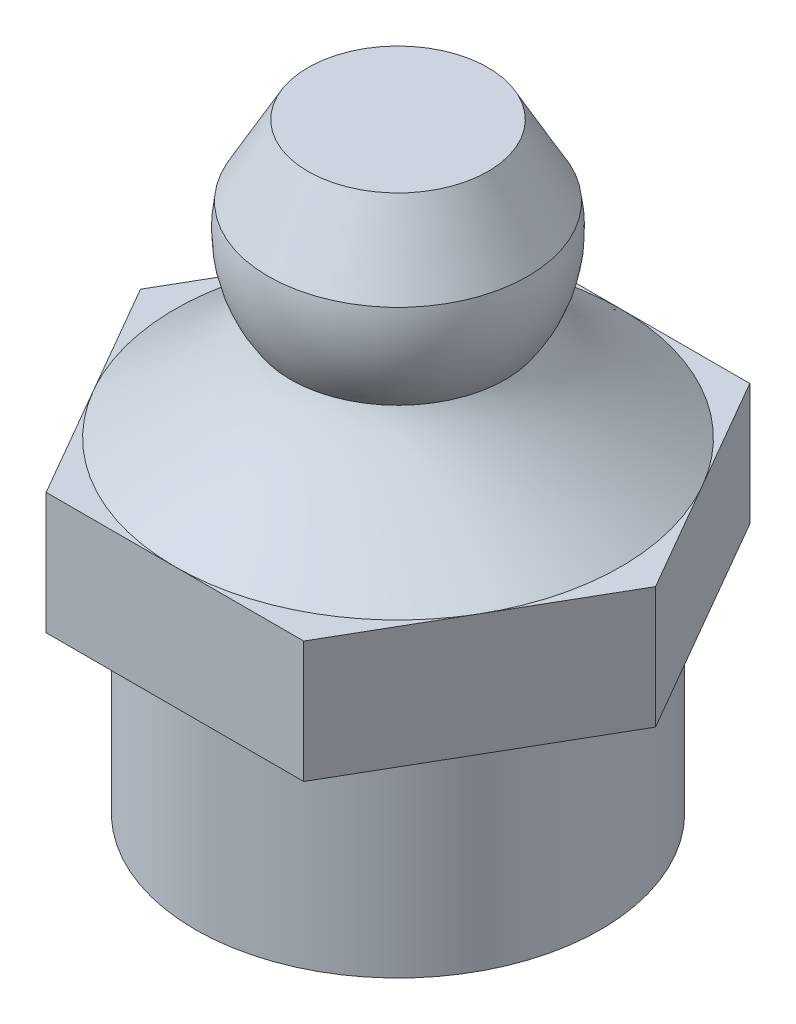
ISO-10303-21;
HEADER;
FILE_DESCRIPTION(('STEP AP214'),'2;1');
FILE_NAME('part.step','',(''),(''),'','','');
FILE_SCHEMA(('AUTOMOTIVE_DESIGN { 1 0 10303 214 1 1 1 1 }'));
ENDSEC;
DATA;
#1=APPLICATION_CONTEXT('core data for automotive mechanical design processes');
#2=APPLICATION_PROTOCOL_DEFINITION('international standard','automotive_design',2000,#1);
#3=PRODUCT_CONTEXT('',#1,'mechanical');
#4=PRODUCT('Part','Part','',(#3));
#5=PRODUCT_RELATED_PRODUCT_CATEGORY('part','',(#4));
#6=PRODUCT_DEFINITION_FORMATION('','',#4);
#7=PRODUCT_DEFINITION_CONTEXT('part definition',#1,'design');
#8=PRODUCT_DEFINITION('design','',#6,#7);
#9=PRODUCT_DEFINITION_SHAPE('','',#8);
#10=(LENGTH_UNIT() NAMED_UNIT(*) SI_UNIT(.MILLI.,.METRE.));
#11=(NAMED_UNIT(*) PLANE_ANGLE_UNIT() SI_UNIT($,.RADIAN.));
#12=(NAMED_UNIT(*) SI_UNIT($,.STERADIAN.) SOLID_ANGLE_UNIT());
#13=UNCERTAINTY_MEASURE_WITH_UNIT(LENGTH_MEASURE(1.E-05),#10,'distance_accuracy_value','');
#14=(GEOMETRIC_REPRESENTATION_CONTEXT(3) GLOBAL_UNCERTAINTY_ASSIGNED_CONTEXT((#13)) GLOBAL_UNIT_ASSIGNED_CONTEXT((#10,
#11,#12)) REPRESENTATION_CONTEXT('',''));
#15=CARTESIAN_POINT('',(0.,0.,0.));
#16=DIRECTION('',(0.,0.,1.));
#17=DIRECTION('',(1.,0.,0.));
#18=AXIS2_PLACEMENT_3D('',#15,#16,#17);
#19=CARTESIAN_POINT('',(0.,8.,0.));
#20=DIRECTION('',(0.,1.,0.));
#21=DIRECTION('',(0.,0.,1.));
#22=AXIS2_PLACEMENT_3D('',#19,#20,#21);
#23=PLANE('',#22);
#24=DIRECTION('',(1.,0.,0.));
#25=VECTOR('',#24,1.);
#26=CARTESIAN_POINT('',(-3.17542648054294,8.,5.5));
#27=LINE('',#26,#25);
#28=CARTESIAN_POINT('',(-3.17542648054294,8.,5.5));
#29=VERTEX_POINT('',#28);
#30=CARTESIAN_POINT('',(0.,8.,5.5));
#31=VERTEX_POINT('',#30);
#32=EDGE_CURVE('E155',#29,#31,#27,.T.);
#33=ORIENTED_EDGE('',*,*,#32,.T.);
#34=CARTESIAN_POINT('',(0.,8.,0.));
#35=DIRECTION('',(0.,-1.,0.));
#36=DIRECTION('',(0.,0.,-1.));
#37=AXIS2_PLACEMENT_3D('',#34,#35,#36);
#38=CIRCLE('',#37,5.5);
#39=CARTESIAN_POINT('',(-4.76299954111656,8.,2.75024191876122));
#40=VERTEX_POINT('',#39);
#41=EDGE_CURVE('E12',#31,#40,#38,.T.);
#42=ORIENTED_EDGE('',*,*,#41,.T.);
#43=DIRECTION('',(0.5,0.,0.866025403784439));
#44=VECTOR('',#43,1.);
#45=CARTESIAN_POINT('',(-6.35085296108588,8.,0.));
#46=LINE('',#45,#44);
#47=EDGE_CURVE('E149',#40,#29,#46,.T.);
#48=ORIENTED_EDGE('',*,*,#47,.T.);
#49=EDGE_LOOP('',(#33,#42,#48));
#50=FACE_BOUND('',#49,.T.);
#51=ADVANCED_FACE('F44',(#50),#23,.T.);
#52=CARTESIAN_POINT('',(-6.35085296108588,8.,0.));
#53=VERTEX_POINT('',#52);
#54=EDGE_CURVE('E124',#53,#40,#46,.T.);
#55=ORIENTED_EDGE('',*,*,#54,.T.);
#56=CARTESIAN_POINT('',(2.58277162522576,8.,-4.85585118510943));
#57=CARTESIAN_POINT('',(-7.1289307449931,8.,-10.021394435561));
#58=CARTESIAN_POINT('',(-12.2944739954446,8.,-0.309692065342095));
#59=CARTESIAN_POINT('',(-2.58277162522576,8.,4.85585118510943));
#60=CARTESIAN_POINT('',(7.1289307449931,8.,10.021394435561));
#61=CARTESIAN_POINT('',(12.2944739954446,8.,0.309692065342091));
#62=CARTESIAN_POINT('',(2.58277162522576,8.,-4.85585118510943));
#63=(BOUNDED_CURVE() B_SPLINE_CURVE(3,(#56,#57,#58,#59,#60,#61,#62),.UNSPECIFIED.,.T.,
.F.) B_SPLINE_CURVE_WITH_KNOTS((4,3,4),(0.,0.5,1.),
.UNSPECIFIED.) CURVE() GEOMETRIC_REPRESENTATION_ITEM() RATIONAL_B_SPLINE_CURVE((1.,
0.333333333333333,0.333333333333333,1.,0.333333333333333,0.333333333333333,1.)) REPRESENTATION_ITEM(''));
#64=CARTESIAN_POINT('',(-4.76318664763266,8.,-2.74992585731315));
#65=VERTEX_POINT('',#64);
#66=EDGE_CURVE('E54',#40,#65,#63,.F.);
#67=ORIENTED_EDGE('',*,*,#66,.T.);
#68=DIRECTION('',(-0.5,0.,0.866025403784438));
#69=VECTOR('',#68,1.);
#70=CARTESIAN_POINT('',(-3.17542648054294,8.,-5.5));
#71=LINE('',#70,#69);
#72=EDGE_CURVE('E119',#65,#53,#71,.T.);
#73=ORIENTED_EDGE('',*,*,#72,.T.);
#74=EDGE_LOOP('',(#55,#67,#73));
#75=FACE_BOUND('',#74,.T.);
#76=ADVANCED_FACE('F121',(#75),#23,.T.);
#77=CARTESIAN_POINT('',(-3.17542648054294,8.,-5.5));
#78=VERTEX_POINT('',#77);
#79=EDGE_CURVE('E131',#78,#65,#71,.T.);
#80=ORIENTED_EDGE('',*,*,#79,.T.);
#81=CARTESIAN_POINT('',(0.,8.,0.));
#82=DIRECTION('',(0.,1.,0.));
#83=DIRECTION('',(0.,0.,1.));
#84=AXIS2_PLACEMENT_3D('',#81,#82,#83);
#85=CIRCLE('',#84,5.5);
#86=CARTESIAN_POINT('',(0.000547968911664734,8.,-5.5000000000506));
#87=VERTEX_POINT('',#86);
#88=EDGE_CURVE('E279',#87,#65,#85,.T.);
#89=ORIENTED_EDGE('',*,*,#88,.F.);
#90=DIRECTION('',(-1.,0.,0.));
#91=VECTOR('',#90,1.);
#92=CARTESIAN_POINT('',(3.17542648054294,8.,-5.5));
#93=LINE('',#92,#91);
#94=EDGE_CURVE('E267',#87,#78,#93,.T.);
#95=ORIENTED_EDGE('',*,*,#94,.T.);
#96=EDGE_LOOP('',(#80,#89,#95));
#97=FACE_BOUND('',#96,.T.);
#98=ADVANCED_FACE('F276',(#97),#23,.T.);
#99=CARTESIAN_POINT('',(3.17542648054294,8.,-5.5));
#100=VERTEX_POINT('',#99);
#101=EDGE_CURVE('E132',#100,#87,#93,.T.);
#102=ORIENTED_EDGE('',*,*,#101,.T.);
#103=CARTESIAN_POINT('',(2.58277162522576,8.,-4.85585118510943));
#104=CARTESIAN_POINT('',(-7.1289307449931,8.,-10.021394435561));
#105=CARTESIAN_POINT('',(-12.2944739954446,8.,-0.309692065342095));
#106=CARTESIAN_POINT('',(-2.58277162522576,8.,4.85585118510943));
#107=CARTESIAN_POINT('',(7.1289307449931,8.,10.021394435561));
#108=CARTESIAN_POINT('',(12.2944739954446,8.,0.309692065342091));
#109=CARTESIAN_POINT('',(2.58277162522576,8.,-4.85585118510943));
#110=(BOUNDED_CURVE() B_SPLINE_CURVE(3,(#103,#104,#105,#106,#107,#108,#109),.UNSPECIFIED.,.T.,
.F.) B_SPLINE_CURVE_WITH_KNOTS((4,3,4),(0.,0.5,1.),
.UNSPECIFIED.) CURVE() GEOMETRIC_REPRESENTATION_ITEM() RATIONAL_B_SPLINE_CURVE((1.,
0.333333333333333,0.333333333333333,1.,0.333333333333333,0.333333333333333,1.)) REPRESENTATION_ITEM(''));
#111=CARTESIAN_POINT('',(4.76299954111715,8.,-2.75024191876018));
#112=VERTEX_POINT('',#111);
#113=EDGE_CURVE('E390',#87,#112,#110,.F.);
#114=ORIENTED_EDGE('',*,*,#113,.T.);
#115=DIRECTION('',(-0.5,0.,-0.866025403784438));
#116=VECTOR('',#115,1.);
#117=CARTESIAN_POINT('',(6.35085296108588,8.,0.));
#118=LINE('',#117,#116);
#119=EDGE_CURVE('E262',#112,#100,#118,.T.);
#120=ORIENTED_EDGE('',*,*,#119,.T.);
#121=EDGE_LOOP('',(#102,#114,#120));
#122=FACE_BOUND('',#121,.T.);
#123=ADVANCED_FACE('F394',(#122),#23,.T.);
#124=CARTESIAN_POINT('',(6.35085296108588,8.,0.));
#125=VERTEX_POINT('',#124);
#126=EDGE_CURVE('E264',#125,#112,#118,.T.);
#127=ORIENTED_EDGE('',*,*,#126,.T.);
#128=CARTESIAN_POINT('',(2.58277162522576,8.,-4.85585118510943));
#129=CARTESIAN_POINT('',(-7.1289307449931,8.,-10.021394435561));
#130=CARTESIAN_POINT('',(-12.2944739954446,8.,-0.309692065342095));
#131=CARTESIAN_POINT('',(-2.58277162522576,8.,4.85585118510943));
#132=CARTESIAN_POINT('',(7.1289307449931,8.,10.021394435561));
#133=CARTESIAN_POINT('',(12.2944739954446,8.,0.309692065342091));
#134=CARTESIAN_POINT('',(2.58277162522576,8.,-4.85585118510943));
#135=(BOUNDED_CURVE() B_SPLINE_CURVE(3,(#128,#129,#130,#131,#132,#133,#134),.UNSPECIFIED.,.T.,
.F.) B_SPLINE_CURVE_WITH_KNOTS((4,3,4),(0.,0.5,1.),
.UNSPECIFIED.) CURVE() GEOMETRIC_REPRESENTATION_ITEM() RATIONAL_B_SPLINE_CURVE((1.,
0.333333333333333,0.333333333333333,1.,0.333333333333333,0.333333333333333,1.)) REPRESENTATION_ITEM(''));
#136=CARTESIAN_POINT('',(4.76318664169245,8.,2.74992586760205));
#137=VERTEX_POINT('',#136);
#138=EDGE_CURVE('E388',#112,#137,#135,.F.);
#139=ORIENTED_EDGE('',*,*,#138,.T.);
#140=DIRECTION('',(0.5,0.,-0.866025403784439));
#141=VECTOR('',#140,1.);
#142=CARTESIAN_POINT('',(3.17542648054294,8.,5.5));
#143=LINE('',#142,#141);
#144=EDGE_CURVE('E105',#137,#125,#143,.T.);
#145=ORIENTED_EDGE('',*,*,#144,.T.);
#146=EDGE_LOOP('',(#127,#139,#145));
#147=FACE_BOUND('',#146,.T.);
#148=ADVANCED_FACE('F421',(#147),#23,.T.);
#149=CARTESIAN_POINT('',(3.17542648054294,8.,5.5));
#150=VERTEX_POINT('',#149);
#151=EDGE_CURVE('E250',#150,#137,#143,.T.);
#152=ORIENTED_EDGE('',*,*,#151,.T.);
#153=CARTESIAN_POINT('',(2.58277162522576,8.,-4.85585118510943));
#154=CARTESIAN_POINT('',(-7.1289307449931,8.,-10.021394435561));
#155=CARTESIAN_POINT('',(-12.2944739954446,8.,-0.309692065342095));
#156=CARTESIAN_POINT('',(-2.58277162522576,8.,4.85585118510943));
#157=CARTESIAN_POINT('',(7.1289307449931,8.,10.021394435561));
#158=CARTESIAN_POINT('',(12.2944739954446,8.,0.309692065342091));
#159=CARTESIAN_POINT('',(2.58277162522576,8.,-4.85585118510943));
#160=(BOUNDED_CURVE() B_SPLINE_CURVE(3,(#153,#154,#155,#156,#157,#158,#159),.UNSPECIFIED.,.T.,
.F.) B_SPLINE_CURVE_WITH_KNOTS((4,3,4),(0.,0.5,1.),
.UNSPECIFIED.) CURVE() GEOMETRIC_REPRESENTATION_ITEM() RATIONAL_B_SPLINE_CURVE((1.,
0.333333333333333,0.333333333333333,1.,0.333333333333333,0.333333333333333,1.)) REPRESENTATION_ITEM(''));
#161=EDGE_CURVE('E177',#137,#31,#160,.F.);
#162=ORIENTED_EDGE('',*,*,#161,.T.);
#163=EDGE_CURVE('E68',#31,#150,#27,.T.);
#164=ORIENTED_EDGE('',*,*,#163,.T.);
#165=EDGE_LOOP('',(#152,#162,#164));
#166=FACE_BOUND('',#165,.T.);
#167=ADVANCED_FACE('F195',(#166),#23,.T.);
#168=CARTESIAN_POINT('',(0.,5.,0.));
#169=DIRECTION('',(0.,-1.,0.));
#170=DIRECTION('',(0.,0.,-1.));
#171=AXIS2_PLACEMENT_3D('',#168,#169,#170);
#172=CYLINDRICAL_SURFACE('',#171,5.);
#173=CARTESIAN_POINT('',(0.,5.,0.));
#174=DIRECTION('',(0.,1.,0.));
#175=DIRECTION('',(0.,0.,1.));
#176=AXIS2_PLACEMENT_3D('',#173,#174,#175);
#177=CIRCLE('',#176,5.);
#178=CARTESIAN_POINT('',(0.,5.,5.));
#179=VERTEX_POINT('',#178);
#180=EDGE_CURVE('E235',#179,#179,#177,.T.);
#181=ORIENTED_EDGE('',*,*,#180,.F.);
#182=EDGE_LOOP('',(#181));
#183=FACE_BOUND('',#182,.T.);
#184=CARTESIAN_POINT('',(0.,0.,0.));
#185=DIRECTION('',(0.,1.,0.));
#186=DIRECTION('',(0.,0.,1.));
#187=AXIS2_PLACEMENT_3D('',#184,#185,#186);
#188=CIRCLE('',#187,5.);
#189=CARTESIAN_POINT('',(0.,0.,5.));
#190=VERTEX_POINT('',#189);
#191=EDGE_CURVE('E232',#190,#190,#188,.T.);
#192=ORIENTED_EDGE('',*,*,#191,.T.);
#193=EDGE_LOOP('',(#192));
#194=FACE_BOUND('',#193,.T.);
#195=ADVANCED_FACE('F46',(#183,#194),#172,.T.);
#196=CARTESIAN_POINT('',(0.,0.,0.));
#197=DIRECTION('',(0.,1.,0.));
#198=DIRECTION('',(0.,0.,1.));
#199=AXIS2_PLACEMENT_3D('',#196,#197,#198);
#200=PLANE('',#199);
#201=ORIENTED_EDGE('',*,*,#191,.F.);
#202=EDGE_LOOP('',(#201));
#203=FACE_BOUND('',#202,.T.);
#204=ADVANCED_FACE('F222',(#203),#200,.F.);
#205=CARTESIAN_POINT('',(3.17542648054294,8.,5.5));
#206=DIRECTION('',(-0.866025403784439,0.,-0.5));
#207=DIRECTION('',(-0.5,0.,0.866025403784439));
#208=AXIS2_PLACEMENT_3D('',#205,#206,#207);
#209=PLANE('',#208);
#210=DIRECTION('',(0.5,0.,-0.866025403784439));
#211=VECTOR('',#210,1.);
#212=CARTESIAN_POINT('',(3.17542648054294,5.,5.5));
#213=LINE('',#212,#211);
#214=CARTESIAN_POINT('',(3.17542648054294,5.,5.5));
#215=VERTEX_POINT('',#214);
#216=CARTESIAN_POINT('',(6.35085296108588,5.,0.));
#217=VERTEX_POINT('',#216);
#218=EDGE_CURVE('E169',#215,#217,#213,.T.);
#219=ORIENTED_EDGE('',*,*,#218,.T.);
#220=DIRECTION('',(0.,-1.,0.));
#221=VECTOR('',#220,1.);
#222=CARTESIAN_POINT('',(6.35085296108588,8.,0.));
#223=LINE('',#222,#221);
#224=EDGE_CURVE('E236',#125,#217,#223,.T.);
#225=ORIENTED_EDGE('',*,*,#224,.F.);
#226=ORIENTED_EDGE('',*,*,#144,.F.);
#227=ORIENTED_EDGE('',*,*,#151,.F.);
#228=DIRECTION('',(0.,-1.,0.));
#229=VECTOR('',#228,1.);
#230=CARTESIAN_POINT('',(3.17542648054294,8.,5.5));
#231=LINE('',#230,#229);
#232=EDGE_CURVE('E175',#150,#215,#231,.T.);
#233=ORIENTED_EDGE('',*,*,#232,.T.);
#234=EDGE_LOOP('',(#219,#225,#226,#227,#233));
#235=FACE_BOUND('',#234,.T.);
#236=ADVANCED_FACE('F219',(#235),#209,.F.);
#237=CARTESIAN_POINT('',(6.35085296108588,8.,0.));
#238=DIRECTION('',(-0.866025403784438,0.,0.5));
#239=DIRECTION('',(0.5,0.,0.866025403784438));
#240=AXIS2_PLACEMENT_3D('',#237,#238,#239);
#241=PLANE('',#240);
#242=DIRECTION('',(-0.5,0.,-0.866025403784438));
#243=VECTOR('',#242,1.);
#244=CARTESIAN_POINT('',(6.35085296108588,5.,0.));
#245=LINE('',#244,#243);
#246=CARTESIAN_POINT('',(3.17542648054294,5.,-5.5));
#247=VERTEX_POINT('',#246);
#248=EDGE_CURVE('E297',#217,#247,#245,.T.);
#249=ORIENTED_EDGE('',*,*,#248,.T.);
#250=DIRECTION('',(0.,-1.,0.));
#251=VECTOR('',#250,1.);
#252=CARTESIAN_POINT('',(3.17542648054294,8.,-5.5));
#253=LINE('',#252,#251);
#254=EDGE_CURVE('E244',#100,#247,#253,.T.);
#255=ORIENTED_EDGE('',*,*,#254,.F.);
#256=ORIENTED_EDGE('',*,*,#119,.F.);
#257=ORIENTED_EDGE('',*,*,#126,.F.);
#258=ORIENTED_EDGE('',*,*,#224,.T.);
#259=EDGE_LOOP('',(#249,#255,#256,#257,#258));
#260=FACE_BOUND('',#259,.T.);
#261=ADVANCED_FACE('F215',(#260),#241,.F.);
#262=CARTESIAN_POINT('',(3.17542648054294,8.,-5.5));
#263=DIRECTION('',(0.,0.,1.));
#264=DIRECTION('',(1.,0.,0.));
#265=AXIS2_PLACEMENT_3D('',#262,#263,#264);
#266=PLANE('',#265);
#267=DIRECTION('',(-1.,0.,0.));
#268=VECTOR('',#267,1.);
#269=CARTESIAN_POINT('',(3.17542648054294,5.,-5.5));
#270=LINE('',#269,#268);
#271=CARTESIAN_POINT('',(-3.17542648054294,5.,-5.5));
#272=VERTEX_POINT('',#271);
#273=EDGE_CURVE('E289',#247,#272,#270,.T.);
#274=ORIENTED_EDGE('',*,*,#273,.T.);
#275=DIRECTION('',(0.,-1.,0.));
#276=VECTOR('',#275,1.);
#277=CARTESIAN_POINT('',(-3.17542648054294,8.,-5.5));
#278=LINE('',#277,#276);
#279=EDGE_CURVE('E143',#78,#272,#278,.T.);
#280=ORIENTED_EDGE('',*,*,#279,.F.);
#281=ORIENTED_EDGE('',*,*,#94,.F.);
#282=ORIENTED_EDGE('',*,*,#101,.F.);
#283=ORIENTED_EDGE('',*,*,#254,.T.);
#284=EDGE_LOOP('',(#274,#280,#281,#282,#283));
#285=FACE_BOUND('',#284,.T.);
#286=ADVANCED_FACE('F212',(#285),#266,.F.);
#287=CARTESIAN_POINT('',(-3.17542648054294,8.,-5.5));
#288=DIRECTION('',(0.866025403784438,0.,0.5));
#289=DIRECTION('',(0.5,0.,-0.866025403784439));
#290=AXIS2_PLACEMENT_3D('',#287,#288,#289);
#291=PLANE('',#290);
#292=DIRECTION('',(-0.5,0.,0.866025403784438));
#293=VECTOR('',#292,1.);
#294=CARTESIAN_POINT('',(-3.17542648054294,5.,-5.5));
#295=LINE('',#294,#293);
#296=CARTESIAN_POINT('',(-6.35085296108588,5.,0.));
#297=VERTEX_POINT('',#296);
#298=EDGE_CURVE('E139',#272,#297,#295,.T.);
#299=ORIENTED_EDGE('',*,*,#298,.T.);
#300=DIRECTION('',(0.,-1.,0.));
#301=VECTOR('',#300,1.);
#302=CARTESIAN_POINT('',(-6.35085296108588,8.,0.));
#303=LINE('',#302,#301);
#304=EDGE_CURVE('E135',#53,#297,#303,.T.);
#305=ORIENTED_EDGE('',*,*,#304,.F.);
#306=ORIENTED_EDGE('',*,*,#72,.F.);
#307=ORIENTED_EDGE('',*,*,#79,.F.);
#308=ORIENTED_EDGE('',*,*,#279,.T.);
#309=EDGE_LOOP('',(#299,#305,#306,#307,#308));
#310=FACE_BOUND('',#309,.T.);
#311=ADVANCED_FACE('F136',(#310),#291,.F.);
#312=CARTESIAN_POINT('',(-6.35085296108588,8.,0.));
#313=DIRECTION('',(0.866025403784438,0.,-0.5));
#314=DIRECTION('',(-0.5,0.,-0.866025403784439));
#315=AXIS2_PLACEMENT_3D('',#312,#313,#314);
#316=PLANE('',#315);
#317=DIRECTION('',(0.5,0.,0.866025403784439));
#318=VECTOR('',#317,1.);
#319=CARTESIAN_POINT('',(-6.35085296108588,5.,0.));
#320=LINE('',#319,#318);
#321=CARTESIAN_POINT('',(-3.17542648054294,5.,5.5));
#322=VERTEX_POINT('',#321);
#323=EDGE_CURVE('E290',#297,#322,#320,.T.);
#324=ORIENTED_EDGE('',*,*,#323,.T.);
#325=DIRECTION('',(0.,-1.,0.));
#326=VECTOR('',#325,1.);
#327=CARTESIAN_POINT('',(-3.17542648054294,8.,5.5));
#328=LINE('',#327,#326);
#329=EDGE_CURVE('E144',#29,#322,#328,.T.);
#330=ORIENTED_EDGE('',*,*,#329,.F.);
#331=ORIENTED_EDGE('',*,*,#47,.F.);
#332=ORIENTED_EDGE('',*,*,#54,.F.);
#333=ORIENTED_EDGE('',*,*,#304,.T.);
#334=EDGE_LOOP('',(#324,#330,#331,#332,#333));
#335=FACE_BOUND('',#334,.T.);
#336=ADVANCED_FACE('F147',(#335),#316,.F.);
#337=CARTESIAN_POINT('',(-3.17542648054294,8.,5.5));
#338=DIRECTION('',(0.,0.,-1.));
#339=DIRECTION('',(-1.,0.,0.));
#340=AXIS2_PLACEMENT_3D('',#337,#338,#339);
#341=PLANE('',#340);
#342=DIRECTION('',(1.,0.,0.));
#343=VECTOR('',#342,1.);
#344=CARTESIAN_POINT('',(-3.17542648054294,5.,5.5));
#345=LINE('',#344,#343);
#346=EDGE_CURVE('E96',#322,#215,#345,.T.);
#347=ORIENTED_EDGE('',*,*,#346,.T.);
#348=ORIENTED_EDGE('',*,*,#232,.F.);
#349=ORIENTED_EDGE('',*,*,#163,.F.);
#350=ORIENTED_EDGE('',*,*,#32,.F.);
#351=ORIENTED_EDGE('',*,*,#329,.T.);
#352=EDGE_LOOP('',(#347,#348,#349,#350,#351));
#353=FACE_BOUND('',#352,.T.);
#354=ADVANCED_FACE('F204',(#353),#341,.F.);
#355=CARTESIAN_POINT('',(0.,5.,0.));
#356=DIRECTION('',(0.,1.,0.));
#357=DIRECTION('',(0.,0.,1.));
#358=AXIS2_PLACEMENT_3D('',#355,#356,#357);
#359=PLANE('',#358);
#360=ORIENTED_EDGE('',*,*,#180,.T.);
#361=EDGE_LOOP('',(#360));
#362=FACE_BOUND('',#361,.T.);
#363=ORIENTED_EDGE('',*,*,#218,.F.);
#364=ORIENTED_EDGE('',*,*,#346,.F.);
#365=ORIENTED_EDGE('',*,*,#323,.F.);
#366=ORIENTED_EDGE('',*,*,#298,.F.);
#367=ORIENTED_EDGE('',*,*,#273,.F.);
#368=ORIENTED_EDGE('',*,*,#248,.F.);
#369=EDGE_LOOP('',(#363,#364,#365,#366,#367,#368));
#370=FACE_BOUND('',#369,.T.);
#371=ADVANCED_FACE('F201',(#362,#370),#359,.F.);
#372=CARTESIAN_POINT('',(2.51875171093667,10.57,-0.823644230632148));
#373=CARTESIAN_POINT('',(2.58277162522576,8.,-4.85585118510943));
#374=CARTESIAN_POINT('',(4.16604017220096,10.57,4.21385919124118));
#375=CARTESIAN_POINT('',(12.2944739954446,8.,0.309692065342091));
#376=CARTESIAN_POINT('',(-0.87146324967237,10.57,5.86114765250548));
#377=CARTESIAN_POINT('',(7.1289307449931,8.,10.021394435561));
#378=CARTESIAN_POINT('',(-2.51875171093667,10.57,0.823644230632147));
#379=CARTESIAN_POINT('',(-2.58277162522576,8.,4.85585118510943));
#380=CARTESIAN_POINT('',(-4.16604017220096,10.57,-4.21385919124118));
#381=CARTESIAN_POINT('',(-12.2944739954446,8.,-0.309692065342095));
#382=CARTESIAN_POINT('',(0.871463249672368,10.57,-5.86114765250548));
#383=CARTESIAN_POINT('',(-7.1289307449931,8.,-10.021394435561));
#384=CARTESIAN_POINT('',(2.51875171093667,10.57,-0.823644230632148));
#385=CARTESIAN_POINT('',(2.58277162522576,8.,-4.85585118510943));
#386=(BOUNDED_SURFACE() B_SPLINE_SURFACE(3,1,((#372,#373),(#374,#375),(#376,#377),(#378,#379),
(#380,#381),(#382,#383),(#384,#385)),.UNSPECIFIED.,.T.,.F.,.F.) B_SPLINE_SURFACE_WITH_KNOTS((4,
3,4),(2,2),(0.,0.5,1.),(0.,1.),
.UNSPECIFIED.) GEOMETRIC_REPRESENTATION_ITEM() RATIONAL_B_SPLINE_SURFACE(((1.,1.),
(0.333333333333333,0.333333333333333),(0.333333333333333,0.333333333333333),(1.,1.),
(0.333333333333334,0.333333333333333),(0.333333333333334,0.333333333333333),(1.,1.))) REPRESENTATION_ITEM('') SURFACE());
#387=CARTESIAN_POINT('',(0.,10.57,0.));
#388=DIRECTION('',(0.,1.,0.));
#389=DIRECTION('',(0.,0.,1.));
#390=AXIS2_PLACEMENT_3D('',#387,#388,#389);
#391=CIRCLE('',#390,2.65);
#392=CARTESIAN_POINT('',(0.,10.57,2.65));
#393=VERTEX_POINT('',#392);
#394=EDGE_CURVE('E319',#393,#393,#391,.T.);
#395=ORIENTED_EDGE('',*,*,#394,.F.);
#396=EDGE_LOOP('',(#395));
#397=FACE_BOUND('',#396,.T.);
#398=ORIENTED_EDGE('',*,*,#88,.T.);
#399=ORIENTED_EDGE('',*,*,#66,.F.);
#400=ORIENTED_EDGE('',*,*,#41,.F.);
#401=ORIENTED_EDGE('',*,*,#161,.F.);
#402=ORIENTED_EDGE('',*,*,#138,.F.);
#403=ORIENTED_EDGE('',*,*,#113,.F.);
#404=EDGE_LOOP('',(#398,#399,#400,#401,#402,#403));
#405=FACE_BOUND('',#404,.T.);
#406=ADVANCED_FACE('F196',(#397,#405),#386,.T.);
#407=CARTESIAN_POINT('',(0.,12.4577078324661,0.));
#408=DIRECTION('',(0.,1.,0.));
#409=DIRECTION('',(0.,0.,1.));
#410=AXIS2_PLACEMENT_3D('',#407,#408,#409);
#411=DEGENERATE_TOROIDAL_SURFACE('',#410,0.00442650088000275,3.25,.T.);
#412=CARTESIAN_POINT('',(0.,13.05,0.));
#413=DIRECTION('',(0.,1.,0.));
#414=DIRECTION('',(0.,0.,1.));
#415=AXIS2_PLACEMENT_3D('',#412,#413,#414);
#416=CIRCLE('',#415,3.2);
#417=CARTESIAN_POINT('',(0.,13.05,3.2));
#418=VERTEX_POINT('',#417);
#419=EDGE_CURVE('E357',#418,#418,#416,.T.);
#420=ORIENTED_EDGE('',*,*,#419,.F.);
#421=EDGE_LOOP('',(#420));
#422=FACE_BOUND('',#421,.T.);
#423=ORIENTED_EDGE('',*,*,#394,.T.);
#424=EDGE_LOOP('',(#423));
#425=FACE_BOUND('',#424,.T.);
#426=ADVANCED_FACE('F333',(#422,#425),#411,.T.);
#427=CARTESIAN_POINT('',(0.,14.8,0.));
#428=DIRECTION('',(0.,-1.,0.));
#429=DIRECTION('',(0.,0.,-1.));
#430=AXIS2_PLACEMENT_3D('',#427,#428,#429);
#431=PLANE('',#430);
#432=CARTESIAN_POINT('',(0.,14.8,0.));
#433=DIRECTION('',(0.,1.,0.));
#434=DIRECTION('',(0.,0.,1.));
#435=AXIS2_PLACEMENT_3D('',#432,#433,#434);
#436=CIRCLE('',#435,2.22);
#437=CARTESIAN_POINT('',(0.,14.8,2.22));
#438=VERTEX_POINT('',#437);
#439=EDGE_CURVE('E325',#438,#438,#436,.T.);
#440=ORIENTED_EDGE('',*,*,#439,.T.);
#441=EDGE_LOOP('',(#440));
#442=FACE_BOUND('',#441,.T.);
#443=ADVANCED_FACE('F342',(#442),#431,.F.);
#444=CARTESIAN_POINT('',(0.,13.05,0.));
#445=DIRECTION('',(0.,-1.,0.));
#446=DIRECTION('',(0.,0.,-1.));
#447=AXIS2_PLACEMENT_3D('',#444,#445,#446);
#448=CONICAL_SURFACE('',#447,3.2,0.510488321916776);
#449=ORIENTED_EDGE('',*,*,#439,.F.);
#450=EDGE_LOOP('',(#449));
#451=FACE_BOUND('',#450,.T.);
#452=ORIENTED_EDGE('',*,*,#419,.T.);
#453=EDGE_LOOP('',(#452));
#454=FACE_BOUND('',#453,.T.);
#455=ADVANCED_FACE('F346',(#451,#454),#448,.T.);
#456=CLOSED_SHELL('',(#51,#76,#98,#123,#148,#167,#195,#204,#236,#261,#286,#311,#336,#354,#371,
#406,#426,#443,#455));
#457=MANIFOLD_SOLID_BREP('B2',#456);
#458=ADVANCED_BREP_SHAPE_REPRESENTATION('',(#18,#457),#14);
#459=SHAPE_DEFINITION_REPRESENTATION(#9,#458);
ENDSEC;
END-ISO-10303-21;
